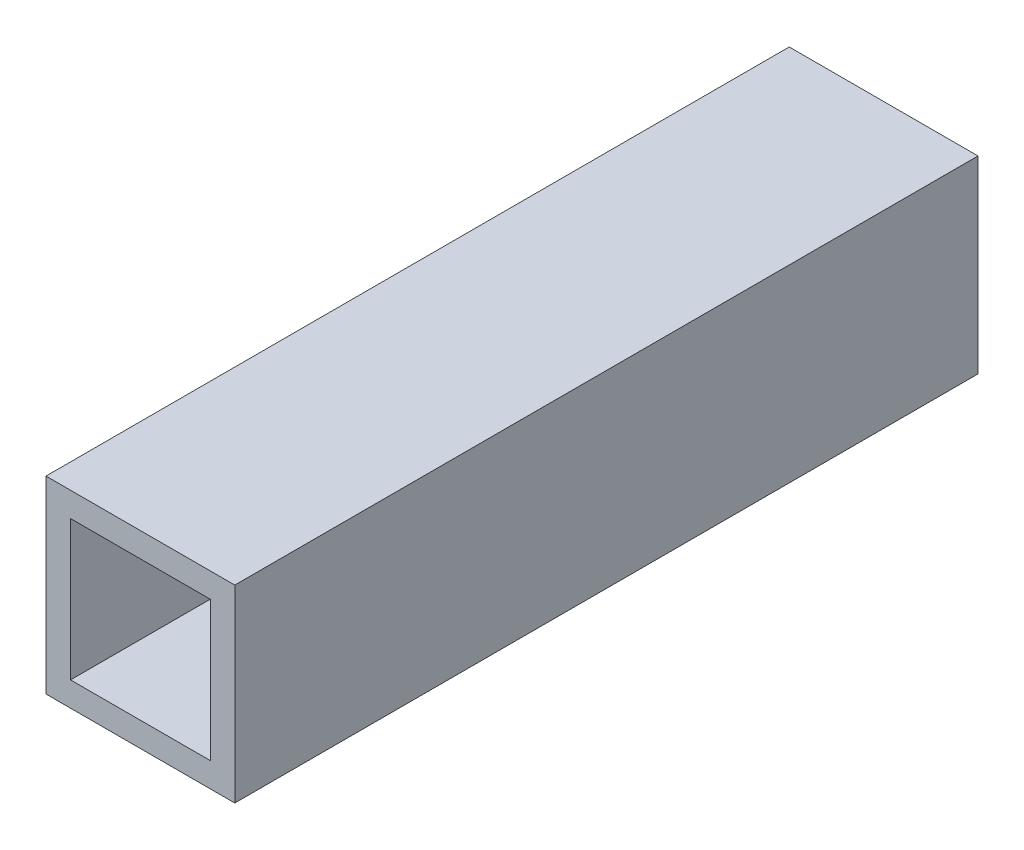
ISO-10303-21;
HEADER;
FILE_DESCRIPTION(('STEP AP214'),'2;1');
FILE_NAME('part.step','',(''),(''),'','','');
FILE_SCHEMA(('AUTOMOTIVE_DESIGN { 1 0 10303 214 1 1 1 1 }'));
ENDSEC;
DATA;
#1=APPLICATION_CONTEXT('core data for automotive mechanical design processes');
#2=APPLICATION_PROTOCOL_DEFINITION('international standard','automotive_design',2000,#1);
#3=PRODUCT_CONTEXT('',#1,'mechanical');
#4=PRODUCT('Part','Part','',(#3));
#5=PRODUCT_RELATED_PRODUCT_CATEGORY('part','',(#4));
#6=PRODUCT_DEFINITION_FORMATION('','',#4);
#7=PRODUCT_DEFINITION_CONTEXT('part definition',#1,'design');
#8=PRODUCT_DEFINITION('design','',#6,#7);
#9=PRODUCT_DEFINITION_SHAPE('','',#8);
#10=(LENGTH_UNIT() NAMED_UNIT(*) SI_UNIT(.MILLI.,.METRE.));
#11=(NAMED_UNIT(*) PLANE_ANGLE_UNIT() SI_UNIT($,.RADIAN.));
#12=(NAMED_UNIT(*) SI_UNIT($,.STERADIAN.) SOLID_ANGLE_UNIT());
#13=UNCERTAINTY_MEASURE_WITH_UNIT(LENGTH_MEASURE(1.E-05),#10,'distance_accuracy_value','');
#14=(GEOMETRIC_REPRESENTATION_CONTEXT(3) GLOBAL_UNCERTAINTY_ASSIGNED_CONTEXT((#13)) GLOBAL_UNIT_ASSIGNED_CONTEXT((#10,
#11,#12)) REPRESENTATION_CONTEXT('',''));
#15=CARTESIAN_POINT('',(0.,0.,0.));
#16=DIRECTION('',(0.,0.,1.));
#17=DIRECTION('',(1.,0.,0.));
#18=AXIS2_PLACEMENT_3D('',#15,#16,#17);
#19=CARTESIAN_POINT('',(0.,0.,50.));
#20=DIRECTION('',(0.,0.,-1.));
#21=DIRECTION('',(-1.,0.,0.));
#22=AXIS2_PLACEMENT_3D('',#19,#20,#21);
#23=PLANE('',#22);
#24=DIRECTION('',(0.,-1.,0.));
#25=VECTOR('',#24,1.);
#26=CARTESIAN_POINT('',(-6.35,6.35,50.));
#27=LINE('',#26,#25);
#28=CARTESIAN_POINT('',(-6.35,6.35,50.));
#29=VERTEX_POINT('',#28);
#30=CARTESIAN_POINT('',(-6.35,-6.35,50.));
#31=VERTEX_POINT('',#30);
#32=EDGE_CURVE('E134',#29,#31,#27,.T.);
#33=ORIENTED_EDGE('',*,*,#32,.T.);
#34=DIRECTION('',(1.,0.,0.));
#35=VECTOR('',#34,1.);
#36=CARTESIAN_POINT('',(6.35,-6.35,50.));
#37=LINE('',#36,#35);
#38=CARTESIAN_POINT('',(6.35,-6.35,50.));
#39=VERTEX_POINT('',#38);
#40=EDGE_CURVE('E137',#31,#39,#37,.T.);
#41=ORIENTED_EDGE('',*,*,#40,.T.);
#42=DIRECTION('',(0.,1.,0.));
#43=VECTOR('',#42,1.);
#44=CARTESIAN_POINT('',(6.35,6.35,50.));
#45=LINE('',#44,#43);
#46=CARTESIAN_POINT('',(6.35,6.35,50.));
#47=VERTEX_POINT('',#46);
#48=EDGE_CURVE('E140',#39,#47,#45,.T.);
#49=ORIENTED_EDGE('',*,*,#48,.T.);
#50=DIRECTION('',(-1.,0.,0.));
#51=VECTOR('',#50,1.);
#52=CARTESIAN_POINT('',(6.35,6.35,50.));
#53=LINE('',#52,#51);
#54=EDGE_CURVE('E142',#47,#29,#53,.T.);
#55=ORIENTED_EDGE('',*,*,#54,.T.);
#56=EDGE_LOOP('',(#33,#41,#49,#55));
#57=FACE_BOUND('',#56,.T.);
#58=DIRECTION('',(0.,-1.,0.));
#59=VECTOR('',#58,1.);
#60=CARTESIAN_POINT('',(-4.7,4.7,50.));
#61=LINE('',#60,#59);
#62=CARTESIAN_POINT('',(-4.7,4.7,50.));
#63=VERTEX_POINT('',#62);
#64=CARTESIAN_POINT('',(-4.7,-4.7,50.));
#65=VERTEX_POINT('',#64);
#66=EDGE_CURVE('E98',#63,#65,#61,.T.);
#67=ORIENTED_EDGE('',*,*,#66,.F.);
#68=DIRECTION('',(-1.,0.,0.));
#69=VECTOR('',#68,1.);
#70=CARTESIAN_POINT('',(4.7,4.7,50.));
#71=LINE('',#70,#69);
#72=CARTESIAN_POINT('',(4.7,4.7,50.));
#73=VERTEX_POINT('',#72);
#74=EDGE_CURVE('E120',#73,#63,#71,.T.);
#75=ORIENTED_EDGE('',*,*,#74,.F.);
#76=DIRECTION('',(0.,1.,0.));
#77=VECTOR('',#76,1.);
#78=CARTESIAN_POINT('',(4.7,4.7,50.));
#79=LINE('',#78,#77);
#80=CARTESIAN_POINT('',(4.7,-4.7,50.));
#81=VERTEX_POINT('',#80);
#82=EDGE_CURVE('E118',#81,#73,#79,.T.);
#83=ORIENTED_EDGE('',*,*,#82,.F.);
#84=DIRECTION('',(1.,0.,0.));
#85=VECTOR('',#84,1.);
#86=CARTESIAN_POINT('',(4.7,-4.7,50.));
#87=LINE('',#86,#85);
#88=EDGE_CURVE('E106',#65,#81,#87,.T.);
#89=ORIENTED_EDGE('',*,*,#88,.F.);
#90=EDGE_LOOP('',(#67,#75,#83,#89));
#91=FACE_BOUND('',#90,.T.);
#92=ADVANCED_FACE('F33',(#57,#91),#23,.F.);
#93=CARTESIAN_POINT('',(0.,0.,0.));
#94=DIRECTION('',(0.,0.,-1.));
#95=DIRECTION('',(-1.,0.,0.));
#96=AXIS2_PLACEMENT_3D('',#93,#94,#95);
#97=PLANE('',#96);
#98=DIRECTION('',(0.,-1.,0.));
#99=VECTOR('',#98,1.);
#100=CARTESIAN_POINT('',(-6.35,6.35,0.));
#101=LINE('',#100,#99);
#102=CARTESIAN_POINT('',(-6.35,6.35,0.));
#103=VERTEX_POINT('',#102);
#104=CARTESIAN_POINT('',(-6.35,-6.35,0.));
#105=VERTEX_POINT('',#104);
#106=EDGE_CURVE('E114',#103,#105,#101,.T.);
#107=ORIENTED_EDGE('',*,*,#106,.F.);
#108=DIRECTION('',(-1.,0.,0.));
#109=VECTOR('',#108,1.);
#110=CARTESIAN_POINT('',(6.35,6.35,0.));
#111=LINE('',#110,#109);
#112=CARTESIAN_POINT('',(6.35,6.35,0.));
#113=VERTEX_POINT('',#112);
#114=EDGE_CURVE('E138',#113,#103,#111,.T.);
#115=ORIENTED_EDGE('',*,*,#114,.F.);
#116=DIRECTION('',(0.,1.,0.));
#117=VECTOR('',#116,1.);
#118=CARTESIAN_POINT('',(6.35,6.35,0.));
#119=LINE('',#118,#117);
#120=CARTESIAN_POINT('',(6.35,-6.35,0.));
#121=VERTEX_POINT('',#120);
#122=EDGE_CURVE('E149',#121,#113,#119,.T.);
#123=ORIENTED_EDGE('',*,*,#122,.F.);
#124=DIRECTION('',(1.,0.,0.));
#125=VECTOR('',#124,1.);
#126=CARTESIAN_POINT('',(6.35,-6.35,0.));
#127=LINE('',#126,#125);
#128=EDGE_CURVE('E147',#105,#121,#127,.T.);
#129=ORIENTED_EDGE('',*,*,#128,.F.);
#130=EDGE_LOOP('',(#107,#115,#123,#129));
#131=FACE_BOUND('',#130,.T.);
#132=DIRECTION('',(-1.,0.,0.));
#133=VECTOR('',#132,1.);
#134=CARTESIAN_POINT('',(4.7,4.7,0.));
#135=LINE('',#134,#133);
#136=CARTESIAN_POINT('',(4.7,4.7,0.));
#137=VERTEX_POINT('',#136);
#138=CARTESIAN_POINT('',(-4.7,4.7,0.));
#139=VERTEX_POINT('',#138);
#140=EDGE_CURVE('E107',#137,#139,#135,.T.);
#141=ORIENTED_EDGE('',*,*,#140,.T.);
#142=DIRECTION('',(0.,-1.,0.));
#143=VECTOR('',#142,1.);
#144=CARTESIAN_POINT('',(-4.7,4.7,0.));
#145=LINE('',#144,#143);
#146=CARTESIAN_POINT('',(-4.7,-4.7,0.));
#147=VERTEX_POINT('',#146);
#148=EDGE_CURVE('E56',#139,#147,#145,.T.);
#149=ORIENTED_EDGE('',*,*,#148,.T.);
#150=DIRECTION('',(1.,0.,0.));
#151=VECTOR('',#150,1.);
#152=CARTESIAN_POINT('',(4.7,-4.7,0.));
#153=LINE('',#152,#151);
#154=CARTESIAN_POINT('',(4.7,-4.7,0.));
#155=VERTEX_POINT('',#154);
#156=EDGE_CURVE('E113',#147,#155,#153,.T.);
#157=ORIENTED_EDGE('',*,*,#156,.T.);
#158=DIRECTION('',(0.,1.,0.));
#159=VECTOR('',#158,1.);
#160=CARTESIAN_POINT('',(4.7,4.7,0.));
#161=LINE('',#160,#159);
#162=EDGE_CURVE('E126',#155,#137,#161,.T.);
#163=ORIENTED_EDGE('',*,*,#162,.T.);
#164=EDGE_LOOP('',(#141,#149,#157,#163));
#165=FACE_BOUND('',#164,.T.);
#166=ADVANCED_FACE('F167',(#131,#165),#97,.T.);
#167=CARTESIAN_POINT('',(-6.35,6.35,50.));
#168=DIRECTION('',(1.,0.,0.));
#169=DIRECTION('',(0.,1.,0.));
#170=AXIS2_PLACEMENT_3D('',#167,#168,#169);
#171=PLANE('',#170);
#172=ORIENTED_EDGE('',*,*,#106,.T.);
#173=DIRECTION('',(0.,0.,-1.));
#174=VECTOR('',#173,1.);
#175=CARTESIAN_POINT('',(-6.35,-6.35,50.));
#176=LINE('',#175,#174);
#177=EDGE_CURVE('E11',#31,#105,#176,.T.);
#178=ORIENTED_EDGE('',*,*,#177,.F.);
#179=ORIENTED_EDGE('',*,*,#32,.F.);
#180=DIRECTION('',(0.,0.,-1.));
#181=VECTOR('',#180,1.);
#182=CARTESIAN_POINT('',(-6.35,6.35,50.));
#183=LINE('',#182,#181);
#184=EDGE_CURVE('E144',#29,#103,#183,.T.);
#185=ORIENTED_EDGE('',*,*,#184,.T.);
#186=EDGE_LOOP('',(#172,#178,#179,#185));
#187=FACE_BOUND('',#186,.T.);
#188=ADVANCED_FACE('F35',(#187),#171,.F.);
#189=CARTESIAN_POINT('',(6.35,-6.35,50.));
#190=DIRECTION('',(0.,1.,0.));
#191=DIRECTION('',(-1.,0.,0.));
#192=AXIS2_PLACEMENT_3D('',#189,#190,#191);
#193=PLANE('',#192);
#194=ORIENTED_EDGE('',*,*,#128,.T.);
#195=DIRECTION('',(0.,0.,-1.));
#196=VECTOR('',#195,1.);
#197=CARTESIAN_POINT('',(6.35,-6.35,50.));
#198=LINE('',#197,#196);
#199=EDGE_CURVE('E41',#39,#121,#198,.T.);
#200=ORIENTED_EDGE('',*,*,#199,.F.);
#201=ORIENTED_EDGE('',*,*,#40,.F.);
#202=ORIENTED_EDGE('',*,*,#177,.T.);
#203=EDGE_LOOP('',(#194,#200,#201,#202));
#204=FACE_BOUND('',#203,.T.);
#205=ADVANCED_FACE('F177',(#204),#193,.F.);
#206=CARTESIAN_POINT('',(6.35,6.35,50.));
#207=DIRECTION('',(-1.,0.,0.));
#208=DIRECTION('',(0.,-1.,0.));
#209=AXIS2_PLACEMENT_3D('',#206,#207,#208);
#210=PLANE('',#209);
#211=ORIENTED_EDGE('',*,*,#122,.T.);
#212=DIRECTION('',(0.,0.,-1.));
#213=VECTOR('',#212,1.);
#214=CARTESIAN_POINT('',(6.35,6.35,50.));
#215=LINE('',#214,#213);
#216=EDGE_CURVE('E154',#47,#113,#215,.T.);
#217=ORIENTED_EDGE('',*,*,#216,.F.);
#218=ORIENTED_EDGE('',*,*,#48,.F.);
#219=ORIENTED_EDGE('',*,*,#199,.T.);
#220=EDGE_LOOP('',(#211,#217,#218,#219));
#221=FACE_BOUND('',#220,.T.);
#222=ADVANCED_FACE('F161',(#221),#210,.F.);
#223=CARTESIAN_POINT('',(6.35,6.35,50.));
#224=DIRECTION('',(0.,-1.,0.));
#225=DIRECTION('',(1.,0.,0.));
#226=AXIS2_PLACEMENT_3D('',#223,#224,#225);
#227=PLANE('',#226);
#228=ORIENTED_EDGE('',*,*,#114,.T.);
#229=ORIENTED_EDGE('',*,*,#184,.F.);
#230=ORIENTED_EDGE('',*,*,#54,.F.);
#231=ORIENTED_EDGE('',*,*,#216,.T.);
#232=EDGE_LOOP('',(#228,#229,#230,#231));
#233=FACE_BOUND('',#232,.T.);
#234=ADVANCED_FACE('F171',(#233),#227,.F.);
#235=CARTESIAN_POINT('',(-4.7,4.7,50.));
#236=DIRECTION('',(1.,0.,0.));
#237=DIRECTION('',(0.,1.,0.));
#238=AXIS2_PLACEMENT_3D('',#235,#236,#237);
#239=PLANE('',#238);
#240=ORIENTED_EDGE('',*,*,#148,.F.);
#241=DIRECTION('',(0.,0.,-1.));
#242=VECTOR('',#241,1.);
#243=CARTESIAN_POINT('',(-4.7,4.7,50.));
#244=LINE('',#243,#242);
#245=EDGE_CURVE('E102',#63,#139,#244,.T.);
#246=ORIENTED_EDGE('',*,*,#245,.F.);
#247=ORIENTED_EDGE('',*,*,#66,.T.);
#248=DIRECTION('',(0.,0.,-1.));
#249=VECTOR('',#248,1.);
#250=CARTESIAN_POINT('',(-4.7,-4.7,50.));
#251=LINE('',#250,#249);
#252=EDGE_CURVE('E101',#65,#147,#251,.T.);
#253=ORIENTED_EDGE('',*,*,#252,.T.);
#254=EDGE_LOOP('',(#240,#246,#247,#253));
#255=FACE_BOUND('',#254,.T.);
#256=ADVANCED_FACE('F100',(#255),#239,.T.);
#257=CARTESIAN_POINT('',(4.7,-4.7,50.));
#258=DIRECTION('',(0.,1.,0.));
#259=DIRECTION('',(-1.,0.,0.));
#260=AXIS2_PLACEMENT_3D('',#257,#258,#259);
#261=PLANE('',#260);
#262=ORIENTED_EDGE('',*,*,#156,.F.);
#263=ORIENTED_EDGE('',*,*,#252,.F.);
#264=ORIENTED_EDGE('',*,*,#88,.T.);
#265=DIRECTION('',(0.,0.,-1.));
#266=VECTOR('',#265,1.);
#267=CARTESIAN_POINT('',(4.7,-4.7,50.));
#268=LINE('',#267,#266);
#269=EDGE_CURVE('E115',#81,#155,#268,.T.);
#270=ORIENTED_EDGE('',*,*,#269,.T.);
#271=EDGE_LOOP('',(#262,#263,#264,#270));
#272=FACE_BOUND('',#271,.T.);
#273=ADVANCED_FACE('F110',(#272),#261,.T.);
#274=CARTESIAN_POINT('',(4.7,4.7,50.));
#275=DIRECTION('',(-1.,0.,0.));
#276=DIRECTION('',(0.,-1.,0.));
#277=AXIS2_PLACEMENT_3D('',#274,#275,#276);
#278=PLANE('',#277);
#279=ORIENTED_EDGE('',*,*,#162,.F.);
#280=ORIENTED_EDGE('',*,*,#269,.F.);
#281=ORIENTED_EDGE('',*,*,#82,.T.);
#282=DIRECTION('',(0.,0.,-1.));
#283=VECTOR('',#282,1.);
#284=CARTESIAN_POINT('',(4.7,4.7,50.));
#285=LINE('',#284,#283);
#286=EDGE_CURVE('E48',#73,#137,#285,.T.);
#287=ORIENTED_EDGE('',*,*,#286,.T.);
#288=EDGE_LOOP('',(#279,#280,#281,#287));
#289=FACE_BOUND('',#288,.T.);
#290=ADVANCED_FACE('F200',(#289),#278,.T.);
#291=CARTESIAN_POINT('',(4.7,4.7,50.));
#292=DIRECTION('',(0.,-1.,0.));
#293=DIRECTION('',(1.,0.,0.));
#294=AXIS2_PLACEMENT_3D('',#291,#292,#293);
#295=PLANE('',#294);
#296=ORIENTED_EDGE('',*,*,#140,.F.);
#297=ORIENTED_EDGE('',*,*,#286,.F.);
#298=ORIENTED_EDGE('',*,*,#74,.T.);
#299=ORIENTED_EDGE('',*,*,#245,.T.);
#300=EDGE_LOOP('',(#296,#297,#298,#299));
#301=FACE_BOUND('',#300,.T.);
#302=ADVANCED_FACE('F204',(#301),#295,.T.);
#303=CLOSED_SHELL('',(#92,#166,#188,#205,#222,#234,#256,#273,#290,#302));
#304=MANIFOLD_SOLID_BREP('B2',#303);
#305=ADVANCED_BREP_SHAPE_REPRESENTATION('',(#18,#304),#14);
#306=SHAPE_DEFINITION_REPRESENTATION(#9,#305);
ENDSEC;
END-ISO-10303-21;
